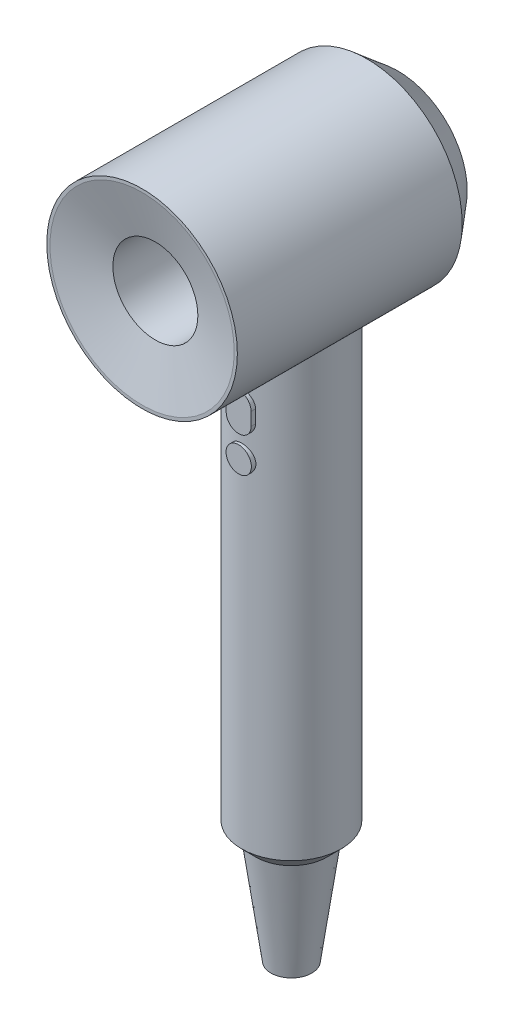
ISO-10303-21;
HEADER;
FILE_DESCRIPTION(('STEP AP214'),'2;1');
FILE_NAME('part.step','',(''),(''),'','','');
FILE_SCHEMA(('AUTOMOTIVE_DESIGN { 1 0 10303 214 1 1 1 1 }'));
ENDSEC;
DATA;
#1=APPLICATION_CONTEXT('core data for automotive mechanical design processes');
#2=APPLICATION_PROTOCOL_DEFINITION('international standard','automotive_design',2000,#1);
#3=PRODUCT_CONTEXT('',#1,'mechanical');
#4=PRODUCT('Part','Part','',(#3));
#5=PRODUCT_RELATED_PRODUCT_CATEGORY('part','',(#4));
#6=PRODUCT_DEFINITION_FORMATION('','',#4);
#7=PRODUCT_DEFINITION_CONTEXT('part definition',#1,'design');
#8=PRODUCT_DEFINITION('design','',#6,#7);
#9=PRODUCT_DEFINITION_SHAPE('','',#8);
#10=(LENGTH_UNIT() NAMED_UNIT(*) SI_UNIT(.MILLI.,.METRE.));
#11=(NAMED_UNIT(*) PLANE_ANGLE_UNIT() SI_UNIT($,.RADIAN.));
#12=(NAMED_UNIT(*) SI_UNIT($,.STERADIAN.) SOLID_ANGLE_UNIT());
#13=UNCERTAINTY_MEASURE_WITH_UNIT(LENGTH_MEASURE(1.E-05),#10,'distance_accuracy_value','');
#14=(GEOMETRIC_REPRESENTATION_CONTEXT(3) GLOBAL_UNCERTAINTY_ASSIGNED_CONTEXT((#13)) GLOBAL_UNIT_ASSIGNED_CONTEXT((#10,
#11,#12)) REPRESENTATION_CONTEXT('',''));
#15=CARTESIAN_POINT('',(0.,0.,0.));
#16=DIRECTION('',(0.,0.,1.));
#17=DIRECTION('',(1.,0.,0.));
#18=AXIS2_PLACEMENT_3D('',#15,#16,#17);
#19=CARTESIAN_POINT('',(-0.0245698483604395,194.743793997136,61.));
#20=DIRECTION('',(0.,0.,-1.));
#21=DIRECTION('',(-1.,0.,0.));
#22=AXIS2_PLACEMENT_3D('',#19,#20,#21);
#23=CYLINDRICAL_SURFACE('',#22,4.76266138417586);
#24=CARTESIAN_POINT('',(-0.0245698483604395,194.743793997136,40.));
#25=DIRECTION('',(0.,0.,1.));
#26=DIRECTION('',(-1.,0.,0.));
#27=AXIS2_PLACEMENT_3D('',#24,#25,#26);
#28=CIRCLE('',#27,4.76266138417586);
#29=CARTESIAN_POINT('',(4.73809153581542,194.743793997136,40.));
#30=VERTEX_POINT('',#29);
#31=CARTESIAN_POINT('',(-4.7872312325363,194.743793997136,40.));
#32=VERTEX_POINT('',#31);
#33=EDGE_CURVE('E121',#30,#32,#28,.T.);
#34=ORIENTED_EDGE('',*,*,#33,.T.);
#35=DIRECTION('',(0.,0.,-1.));
#36=VECTOR('',#35,1.);
#37=CARTESIAN_POINT('',(-4.7872312325363,194.743793997136,61.));
#38=LINE('',#37,#36);
#39=CARTESIAN_POINT('',(-4.7872312325363,194.743793997136,61.));
#40=VERTEX_POINT('',#39);
#41=EDGE_CURVE('E13',#40,#32,#38,.T.);
#42=ORIENTED_EDGE('',*,*,#41,.F.);
#43=CARTESIAN_POINT('',(-0.0245698483604395,194.743793997136,61.));
#44=DIRECTION('',(0.,0.,1.));
#45=DIRECTION('',(-1.,0.,0.));
#46=AXIS2_PLACEMENT_3D('',#43,#44,#45);
#47=CIRCLE('',#46,4.76266138417586);
#48=CARTESIAN_POINT('',(4.73809153581542,194.743793997136,61.));
#49=VERTEX_POINT('',#48);
#50=EDGE_CURVE('E109',#49,#40,#47,.T.);
#51=ORIENTED_EDGE('',*,*,#50,.F.);
#52=DIRECTION('',(0.,0.,-1.));
#53=VECTOR('',#52,1.);
#54=CARTESIAN_POINT('',(4.73809153581542,194.743793997136,61.));
#55=LINE('',#54,#53);
#56=EDGE_CURVE('E117',#49,#30,#55,.T.);
#57=ORIENTED_EDGE('',*,*,#56,.T.);
#58=EDGE_LOOP('',(#34,#42,#51,#57));
#59=FACE_BOUND('',#58,.T.);
#60=ADVANCED_FACE('F58',(#59),#23,.T.);
#61=CARTESIAN_POINT('',(-4.7872312325363,189.778466171081,61.));
#62=DIRECTION('',(1.,0.,0.));
#63=DIRECTION('',(0.,0.,-1.));
#64=AXIS2_PLACEMENT_3D('',#61,#62,#63);
#65=PLANE('',#64);
#66=DIRECTION('',(0.,-1.,0.));
#67=VECTOR('',#66,1.);
#68=CARTESIAN_POINT('',(-4.7872312325363,189.778466171081,40.));
#69=LINE('',#68,#67);
#70=CARTESIAN_POINT('',(-4.7872312325363,189.778466171081,40.));
#71=VERTEX_POINT('',#70);
#72=EDGE_CURVE('E113',#32,#71,#69,.T.);
#73=ORIENTED_EDGE('',*,*,#72,.T.);
#74=DIRECTION('',(0.,0.,-1.));
#75=VECTOR('',#74,1.);
#76=CARTESIAN_POINT('',(-4.7872312325363,189.778466171081,61.));
#77=LINE('',#76,#75);
#78=CARTESIAN_POINT('',(-4.7872312325363,189.778466171081,61.));
#79=VERTEX_POINT('',#78);
#80=EDGE_CURVE('E66',#79,#71,#77,.T.);
#81=ORIENTED_EDGE('',*,*,#80,.F.);
#82=DIRECTION('',(0.,-1.,0.));
#83=VECTOR('',#82,1.);
#84=CARTESIAN_POINT('',(-4.7872312325363,189.778466171081,61.));
#85=LINE('',#84,#83);
#86=EDGE_CURVE('E104',#40,#79,#85,.T.);
#87=ORIENTED_EDGE('',*,*,#86,.F.);
#88=ORIENTED_EDGE('',*,*,#41,.T.);
#89=EDGE_LOOP('',(#73,#81,#87,#88));
#90=FACE_BOUND('',#89,.T.);
#91=ADVANCED_FACE('F112',(#90),#65,.F.);
#92=CARTESIAN_POINT('',(-0.0245698483604395,189.778466171081,61.));
#93=DIRECTION('',(0.,0.,-1.));
#94=DIRECTION('',(-1.,0.,0.));
#95=AXIS2_PLACEMENT_3D('',#92,#93,#94);
#96=CYLINDRICAL_SURFACE('',#95,4.76266138417586);
#97=CARTESIAN_POINT('',(-0.0245698483604395,189.778466171081,40.));
#98=DIRECTION('',(0.,0.,1.));
#99=DIRECTION('',(-1.,0.,0.));
#100=AXIS2_PLACEMENT_3D('',#97,#98,#99);
#101=CIRCLE('',#100,4.76266138417586);
#102=CARTESIAN_POINT('',(4.73809153581542,189.778466171081,40.));
#103=VERTEX_POINT('',#102);
#104=EDGE_CURVE('E91',#71,#103,#101,.T.);
#105=ORIENTED_EDGE('',*,*,#104,.T.);
#106=DIRECTION('',(0.,0.,-1.));
#107=VECTOR('',#106,1.);
#108=CARTESIAN_POINT('',(4.73809153581542,189.778466171081,61.));
#109=LINE('',#108,#107);
#110=CARTESIAN_POINT('',(4.73809153581542,189.778466171081,61.));
#111=VERTEX_POINT('',#110);
#112=EDGE_CURVE('E114',#111,#103,#109,.T.);
#113=ORIENTED_EDGE('',*,*,#112,.F.);
#114=CARTESIAN_POINT('',(-0.0245698483604395,189.778466171081,61.));
#115=DIRECTION('',(0.,0.,1.));
#116=DIRECTION('',(-1.,0.,0.));
#117=AXIS2_PLACEMENT_3D('',#114,#115,#116);
#118=CIRCLE('',#117,4.76266138417586);
#119=EDGE_CURVE('E107',#79,#111,#118,.T.);
#120=ORIENTED_EDGE('',*,*,#119,.F.);
#121=ORIENTED_EDGE('',*,*,#80,.T.);
#122=EDGE_LOOP('',(#105,#113,#120,#121));
#123=FACE_BOUND('',#122,.T.);
#124=ADVANCED_FACE('F115',(#123),#96,.T.);
#125=CARTESIAN_POINT('',(4.73809153581542,194.743793997136,61.));
#126=DIRECTION('',(-1.,0.,0.));
#127=DIRECTION('',(0.,0.,1.));
#128=AXIS2_PLACEMENT_3D('',#125,#126,#127);
#129=PLANE('',#128);
#130=DIRECTION('',(0.,1.,0.));
#131=VECTOR('',#130,1.);
#132=CARTESIAN_POINT('',(4.73809153581542,194.743793997136,40.));
#133=LINE('',#132,#131);
#134=EDGE_CURVE('E97',#103,#30,#133,.T.);
#135=ORIENTED_EDGE('',*,*,#134,.T.);
#136=ORIENTED_EDGE('',*,*,#56,.F.);
#137=DIRECTION('',(0.,1.,0.));
#138=VECTOR('',#137,1.);
#139=CARTESIAN_POINT('',(4.73809153581542,194.743793997136,61.));
#140=LINE('',#139,#138);
#141=EDGE_CURVE('E74',#111,#49,#140,.T.);
#142=ORIENTED_EDGE('',*,*,#141,.F.);
#143=ORIENTED_EDGE('',*,*,#112,.T.);
#144=EDGE_LOOP('',(#135,#136,#142,#143));
#145=FACE_BOUND('',#144,.T.);
#146=ADVANCED_FACE('F128',(#145),#129,.F.);
#147=CARTESIAN_POINT('',(-0.0245698483604395,194.743793997136,61.));
#148=DIRECTION('',(0.,0.,-1.));
#149=DIRECTION('',(-1.,0.,0.));
#150=AXIS2_PLACEMENT_3D('',#147,#148,#149);
#151=PLANE('',#150);
#152=ORIENTED_EDGE('',*,*,#50,.T.);
#153=ORIENTED_EDGE('',*,*,#86,.T.);
#154=ORIENTED_EDGE('',*,*,#119,.T.);
#155=ORIENTED_EDGE('',*,*,#141,.T.);
#156=EDGE_LOOP('',(#152,#153,#154,#155));
#157=FACE_BOUND('',#156,.T.);
#158=ADVANCED_FACE('F105',(#157),#151,.F.);
#159=CARTESIAN_POINT('',(-0.0245698483604395,194.743793997136,40.));
#160=DIRECTION('',(0.,0.,-1.));
#161=DIRECTION('',(-1.,0.,0.));
#162=AXIS2_PLACEMENT_3D('',#159,#160,#161);
#163=PLANE('',#162);
#164=ORIENTED_EDGE('',*,*,#33,.F.);
#165=ORIENTED_EDGE('',*,*,#134,.F.);
#166=ORIENTED_EDGE('',*,*,#104,.F.);
#167=ORIENTED_EDGE('',*,*,#72,.F.);
#168=EDGE_LOOP('',(#164,#165,#166,#167));
#169=FACE_BOUND('',#168,.T.);
#170=ADVANCED_FACE('F131',(#169),#163,.T.);
#171=CLOSED_SHELL('',(#60,#91,#124,#146,#158,#170));
#172=MANIFOLD_SOLID_BREP('B2',#171);
#173=CARTESIAN_POINT('',(0.,176.503814227952,61.));
#174=DIRECTION('',(0.,0.,-1.));
#175=DIRECTION('',(-1.,0.,0.));
#176=AXIS2_PLACEMENT_3D('',#173,#174,#175);
#177=CYLINDRICAL_SURFACE('',#176,4.84601829714736);
#178=CARTESIAN_POINT('',(0.,176.503814227952,61.));
#179=DIRECTION('',(0.,0.,1.));
#180=DIRECTION('',(1.,0.,0.));
#181=AXIS2_PLACEMENT_3D('',#178,#179,#180);
#182=CIRCLE('',#181,4.84601829714736);
#183=CARTESIAN_POINT('',(4.84601829714736,176.503814227952,61.));
#184=VERTEX_POINT('',#183);
#185=EDGE_CURVE('E57',#184,#184,#182,.T.);
#186=ORIENTED_EDGE('',*,*,#185,.F.);
#187=EDGE_LOOP('',(#186));
#188=FACE_BOUND('',#187,.T.);
#189=CARTESIAN_POINT('',(0.,176.503814227952,40.));
#190=DIRECTION('',(0.,0.,1.));
#191=DIRECTION('',(1.,0.,0.));
#192=AXIS2_PLACEMENT_3D('',#189,#190,#191);
#193=CIRCLE('',#192,4.84601829714736);
#194=CARTESIAN_POINT('',(4.84601829714736,176.503814227952,40.));
#195=VERTEX_POINT('',#194);
#196=EDGE_CURVE('E192',#195,#195,#193,.T.);
#197=ORIENTED_EDGE('',*,*,#196,.T.);
#198=EDGE_LOOP('',(#197));
#199=FACE_BOUND('',#198,.T.);
#200=ADVANCED_FACE('F189',(#188,#199),#177,.T.);
#201=CARTESIAN_POINT('',(0.,176.503814227952,61.));
#202=DIRECTION('',(0.,0.,1.));
#203=DIRECTION('',(1.,0.,0.));
#204=AXIS2_PLACEMENT_3D('',#201,#202,#203);
#205=PLANE('',#204);
#206=ORIENTED_EDGE('',*,*,#185,.T.);
#207=EDGE_LOOP('',(#206));
#208=FACE_BOUND('',#207,.T.);
#209=ADVANCED_FACE('F204',(#208),#205,.T.);
#210=CARTESIAN_POINT('',(0.,176.503814227952,40.));
#211=DIRECTION('',(0.,0.,1.));
#212=DIRECTION('',(1.,0.,0.));
#213=AXIS2_PLACEMENT_3D('',#210,#211,#212);
#214=PLANE('',#213);
#215=ORIENTED_EDGE('',*,*,#196,.F.);
#216=EDGE_LOOP('',(#215));
#217=FACE_BOUND('',#216,.T.);
#218=ADVANCED_FACE('F202',(#217),#214,.F.);
#219=CLOSED_SHELL('',(#200,#209,#218));
#220=MANIFOLD_SOLID_BREP('B7',#219);
#221=CARTESIAN_POINT('',(1.11022302462516E-13,248.274519969354,98.));
#222=DIRECTION('',(0.,0.,-1.));
#223=DIRECTION('',(-1.,0.,0.));
#224=AXIS2_PLACEMENT_3D('',#221,#222,#223);
#225=CYLINDRICAL_SURFACE('',#224,36.4826501961415);
#226=CARTESIAN_POINT('',(1.11022302462516E-13,248.274519969354,11.917535925942));
#227=DIRECTION('',(0.,0.,1.));
#228=DIRECTION('',(1.,0.,0.));
#229=AXIS2_PLACEMENT_3D('',#226,#227,#228);
#230=CIRCLE('',#229,36.4826501961415);
#231=CARTESIAN_POINT('',(36.4826501961416,248.274519969354,11.917535925942));
#232=VERTEX_POINT('',#231);
#233=EDGE_CURVE('E237',#232,#232,#230,.T.);
#234=ORIENTED_EDGE('',*,*,#233,.T.);
#235=EDGE_LOOP('',(#234));
#236=FACE_BOUND('',#235,.T.);
#237=CARTESIAN_POINT('',(0.,211.791869773212,59.9095493020376));
#238=CARTESIAN_POINT('',(0.498903942082183,211.791869193612,59.9095500564646));
#239=CARTESIAN_POINT('',(0.997800418017843,211.802125818302,59.8899588136509));
#240=CARTESIAN_POINT('',(1.99188304117443,211.842889168534,59.8118336670004));
#241=CARTESIAN_POINT('',(2.48706773471261,211.873403447519,59.7532852372334));
#242=CARTESIAN_POINT('',(3.47050051507506,211.953958550671,59.5978503014503));
#243=CARTESIAN_POINT('',(3.95873738240978,212.004027903182,59.5009077804611));
#244=CARTESIAN_POINT('',(4.92400380826177,212.12241908089,59.269847248366));
#245=CARTESIAN_POINT('',(5.40103429688597,212.19073938543,59.1357323344033));
#246=CARTESIAN_POINT('',(6.33891025175676,212.343657828775,58.832402653579));
#247=CARTESIAN_POINT('',(6.79981325995625,212.428189171414,58.6633317041285));
#248=CARTESIAN_POINT('',(7.704770955944,212.611745766169,58.2914073762051));
#249=CARTESIAN_POINT('',(8.14882535175242,212.710771269318,58.0885534126137));
#250=CARTESIAN_POINT('',(9.01771559972236,212.92109914636,57.6508388508836));
#251=CARTESIAN_POINT('',(9.44255450571534,213.03239955972,57.415983362578));
#252=CARTESIAN_POINT('',(10.2711750841071,213.264922058321,56.9159692026788));
#253=CARTESIAN_POINT('',(10.6749549300252,213.386145001822,56.6508079089656));
#254=CARTESIAN_POINT('',(11.4850260610042,213.64404134703,56.0738870436414));
#255=CARTESIAN_POINT('',(11.8898075156644,213.781207012662,55.7602270314189));
#256=CARTESIAN_POINT('',(12.6718434746124,214.060770974813,55.1024178020636));
#257=CARTESIAN_POINT('',(13.0490969969633,214.203169457718,54.7582674982936));
#258=CARTESIAN_POINT('',(13.7747499933389,214.490021108415,54.0409922882267));
#259=CARTESIAN_POINT('',(14.1231268649438,214.634475783928,53.6678451198464));
#260=CARTESIAN_POINT('',(14.7891423782619,214.921909717534,52.8945037148832));
#261=CARTESIAN_POINT('',(15.1067795095139,215.064888902818,52.4943081508603));
#262=CARTESIAN_POINT('',(15.7359544992434,215.358046829545,51.6325801445666));
#263=CARTESIAN_POINT('',(16.0445552106486,215.507769055975,51.168740787601));
#264=CARTESIAN_POINT('',(16.6212705287736,215.796509482958,50.2133930769064));
#265=CARTESIAN_POINT('',(16.8893878912654,215.935528411787,49.7218866096555));
#266=CARTESIAN_POINT('',(17.3826359481922,216.197958721282,48.7140320182238));
#267=CARTESIAN_POINT('',(17.6077882582708,216.321377939528,48.1976965500435));
#268=CARTESIAN_POINT('',(18.0127051648197,216.547873136246,47.1432043297721));
#269=CARTESIAN_POINT('',(18.1924752493353,216.650951574186,46.6050502253392));
#270=CARTESIAN_POINT('',(18.4945117369379,216.826698918164,45.5447470403825));
#271=CARTESIAN_POINT('',(18.6196437551711,216.900852687152,45.0236620041971));
#272=CARTESIAN_POINT('',(18.8259357341679,217.024201127376,43.9699192683275));
#273=CARTESIAN_POINT('',(18.9070977492877,217.073396964684,43.4372621105229));
#274=CARTESIAN_POINT('',(19.0240460124975,217.144564095212,42.3657077318946));
#275=CARTESIAN_POINT('',(19.059877645118,217.166562617732,41.8268172983229));
#276=CARTESIAN_POINT('',(19.0856675653614,217.182377303399,40.7475528534586));
#277=CARTESIAN_POINT('',(19.0756310107172,217.176196635207,40.2071790157992));
#278=CARTESIAN_POINT('',(19.0143069061885,217.138674544179,39.2025594122427));
#279=CARTESIAN_POINT('',(18.9687300305484,217.110817366347,38.7378198550446));
#280=CARTESIAN_POINT('',(18.8439524039514,217.035208955622,37.8145675099738));
#281=CARTESIAN_POINT('',(18.7647552096035,216.987459827058,37.3560540687491));
#282=CARTESIAN_POINT('',(18.5736656701137,216.87364357262,36.4480966836742));
#283=CARTESIAN_POINT('',(18.4617634770695,216.807570929602,35.9986555152454));
#284=CARTESIAN_POINT('',(18.2064757551503,216.659179157247,35.1115604565937));
#285=CARTESIAN_POINT('',(18.0630884178625,216.576859094733,34.6739072450574));
#286=CARTESIAN_POINT('',(17.7425953580108,216.396335695892,33.8028905386461));
#287=CARTESIAN_POINT('',(17.564802531004,216.297816200118,33.3698460317048));
#288=CARTESIAN_POINT('',(17.179079959089,216.088947509886,32.5201643230799));
#289=CARTESIAN_POINT('',(16.9711377972416,215.978593446287,32.1035339718788));
#290=CARTESIAN_POINT('',(16.52655727509,215.748849117278,31.2884316249294));
#291=CARTESIAN_POINT('',(16.289915533808,215.629457787849,30.8899617762163));
#292=CARTESIAN_POINT('',(15.7892752587461,215.384396338695,30.1126070088077));
#293=CARTESIAN_POINT('',(15.5252743437139,215.258725672931,29.7337237991776));
#294=CARTESIAN_POINT('',(14.9322071641093,214.985874686671,28.9450317285036));
#295=CARTESIAN_POINT('',(14.5992108044442,214.838153245621,28.5383582423615));
#296=CARTESIAN_POINT('',(13.9009811791859,214.541889988999,27.7539862031804));
#297=CARTESIAN_POINT('',(13.535745339787,214.393348108819,27.3762899680178));
#298=CARTESIAN_POINT('',(12.774531282853,214.099065367796,26.6515514107999));
#299=CARTESIAN_POINT('',(12.3785355342971,213.953326164193,26.3045268138967));
#300=CARTESIAN_POINT('',(11.557798353244,213.668310070582,25.643393111455));
#301=CARTESIAN_POINT('',(11.1330581153505,213.52903291242,25.3292826394063));
#302=CARTESIAN_POINT('',(10.2324939597813,213.252902436619,24.7196477857472));
#303=CARTESIAN_POINT('',(9.755143605248,213.116610849186,24.4261170856618));
#304=CARTESIAN_POINT('',(8.77331559793282,212.858841530941,23.8807329263617));
#305=CARTESIAN_POINT('',(8.26883647924717,212.737364601802,23.6288817223043));
#306=CARTESIAN_POINT('',(7.23643224577196,212.512855547966,23.1697494874146));
#307=CARTESIAN_POINT('',(6.70852356906615,212.409810738925,22.9624377861346));
#308=CARTESIAN_POINT('',(5.63295543935523,212.225232250228,22.5947966053925));
#309=CARTESIAN_POINT('',(5.08529850951474,212.143695833513,22.4344611476604));
#310=CARTESIAN_POINT('',(4.02367740384683,212.010841457169,22.1749543618603));
#311=CARTESIAN_POINT('',(3.51097436694164,211.957499488754,22.0716501118355));
#312=CARTESIAN_POINT('',(2.47705976105866,211.87236479024,21.9073620959927));
#313=CARTESIAN_POINT('',(1.95584868089588,211.840570826569,21.8463759075611));
#314=CARTESIAN_POINT('',(0.909528317321504,211.799452686707,21.7675853153378));
#315=CARTESIAN_POINT('',(0.384420923133845,211.790118254153,21.7497612011439));
#316=CARTESIAN_POINT('',(-0.66537340052037,211.794162197201,21.7574938121755));
#317=CARTESIAN_POINT('',(-1.19006035072981,211.807539373202,21.7830482461983));
#318=CARTESIAN_POINT('',(-2.18921814936357,211.854481386349,21.8730808898464));
#319=CARTESIAN_POINT('',(-2.66410265040614,211.886197571326,21.9339965036698));
#320=CARTESIAN_POINT('',(-3.60643331811186,211.967481855119,22.0909929750075));
#321=CARTESIAN_POINT('',(-4.07388001634235,212.017048672141,22.1870713076149));
#322=CARTESIAN_POINT('',(-4.99832573108141,212.132888065767,22.4133579706043));
#323=CARTESIAN_POINT('',(-5.45532420037248,212.199161515191,22.5435680841789));
#324=CARTESIAN_POINT('',(-6.3561294909815,212.346929712811,22.8368176722343));
#325=CARTESIAN_POINT('',(-6.79993574441351,212.42842511517,22.9998585576409));
#326=CARTESIAN_POINT('',(-7.68336722083116,212.60719557407,23.3619806332182));
#327=CARTESIAN_POINT('',(-8.12257864459276,212.704827952135,23.561893770467));
#328=CARTESIAN_POINT('',(-8.98234213145659,212.912154730477,23.9930611439112));
#329=CARTESIAN_POINT('',(-9.40289407352497,213.021849208979,24.2243155833611));
#330=CARTESIAN_POINT('',(-10.2235721379162,213.25104338609,24.7165522283839));
#331=CARTESIAN_POINT('',(-10.6236924023861,213.370545871378,24.9775428909304));
#332=CARTESIAN_POINT('',(-11.401783205124,213.616913538935,25.5275773630126));
#333=CARTESIAN_POINT('',(-11.7797518849999,213.743779337173,25.8166235208571));
#334=CARTESIAN_POINT('',(-12.5505251779763,214.015913086689,26.452942878888));
#335=CARTESIAN_POINT('',(-12.9407285103267,214.161715595272,26.8031434888106));
#336=CARTESIAN_POINT('',(-13.6905816435833,214.455679428641,27.5339392000314));
#337=CARTESIAN_POINT('',(-14.0502294841717,214.603840904047,27.9145362484086));
#338=CARTESIAN_POINT('',(-14.7375977891708,214.89897570882,28.7046644233162));
#339=CARTESIAN_POINT('',(-15.0652918864507,215.045947966711,29.1142189718652));
#340=CARTESIAN_POINT('',(-15.5312114662793,215.262482780258,29.7485153409061));
#341=CARTESIAN_POINT('',(-15.6822524139675,215.334009478862,29.9632825010813));
#342=CARTESIAN_POINT('',(-15.9756453706037,215.475296894831,30.3993455914707));
#343=CARTESIAN_POINT('',(-16.1179944997642,215.54505702246,30.620643649876));
#344=CARTESIAN_POINT('',(-16.5484476998395,215.759301444761,31.3213491350747));
#345=CARTESIAN_POINT('',(-16.8208789387418,215.899802183988,31.8117545556657));
#346=CARTESIAN_POINT('',(-17.3228448721418,216.165587224573,32.8179969272785));
#347=CARTESIAN_POINT('',(-17.5523844889193,216.290873271403,33.3338309514942));
#348=CARTESIAN_POINT('',(-17.8624953887037,216.463688651295,34.1238919066173));
#349=CARTESIAN_POINT('',(-17.9601398853026,216.518759464119,34.3898752468776));
#350=CARTESIAN_POINT('',(-18.1437570477627,216.623311712507,34.9268351771187));
#351=CARTESIAN_POINT('',(-18.2297327037829,216.672794579445,35.1978104676136));
#352=CARTESIAN_POINT('',(-18.4697009336932,216.81202875833,36.0175471578565));
#353=CARTESIAN_POINT('',(-18.6058037470356,216.892604603268,36.5732946699038));
#354=CARTESIAN_POINT('',(-18.8170137415373,217.01884309429,37.6429111662931));
#355=CARTESIAN_POINT('',(-18.8967851317518,217.06714991156,38.1555589942756));
#356=CARTESIAN_POINT('',(-19.0143496384965,217.138639215082,39.187413615692));
#357=CARTESIAN_POINT('',(-19.0521457340967,217.161823484327,39.7066199410107));
#358=CARTESIAN_POINT('',(-19.0851214695621,217.182040531689,40.746624234408));
#359=CARTESIAN_POINT('',(-19.0803225431504,217.179086462562,41.2674212701686));
#360=CARTESIAN_POINT('',(-19.0282405672082,217.14718851684,42.3060636062432));
#361=CARTESIAN_POINT('',(-18.9809599423996,217.118246123576,42.823909073326));
#362=CARTESIAN_POINT('',(-18.8524194946347,217.04032521563,43.7938137668714));
#363=CARTESIAN_POINT('',(-18.7756101247334,216.993984559403,44.2466863377623));
#364=CARTESIAN_POINT('',(-18.5901231826813,216.883394832128,45.1435738133244));
#365=CARTESIAN_POINT('',(-18.4814486159577,216.819147450016,45.5875895491287));
#366=CARTESIAN_POINT('',(-18.2333457562769,216.674687029067,46.4643775471388));
#367=CARTESIAN_POINT('',(-18.093909433975,216.594469822368,46.8971468408036));
#368=CARTESIAN_POINT('',(-17.7855719507099,216.420344088925,47.7492199231832));
#369=CARTESIAN_POINT('',(-17.6166687305324,216.32643460541,48.1685227684054));
#370=CARTESIAN_POINT('',(-17.2387231355716,216.120835445997,49.0188385953159));
#371=CARTESIAN_POINT('',(-17.0277766451753,216.008384172761,49.4488205450675));
#372=CARTESIAN_POINT('',(-16.5753789175956,215.773665735848,50.2898389639274));
#373=CARTESIAN_POINT('',(-16.3339145758564,215.651394363631,50.7008671900832));
#374=CARTESIAN_POINT('',(-15.8219431513721,215.400043518436,51.5023535121827));
#375=CARTESIAN_POINT('',(-15.5514295535735,215.270962521539,51.8928069643034));
#376=CARTESIAN_POINT('',(-14.9827517650178,215.008938049415,52.6516709174042));
#377=CARTESIAN_POINT('',(-14.6845856236062,214.875994302159,53.0200798603092));
#378=CARTESIAN_POINT('',(-14.0190887177274,214.590735798951,53.7825308117801));
#379=CARTESIAN_POINT('',(-13.6478831467707,214.438268480307,54.1731432208179));
#380=CARTESIAN_POINT('',(-12.873178280648,214.136008773259,54.9221089959284));
#381=CARTESIAN_POINT('',(-12.4696760404007,213.986216630326,55.2804594137365));
#382=CARTESIAN_POINT('',(-11.6320306388974,213.693070901962,55.9629637370589));
#383=CARTESIAN_POINT('',(-11.1978677914904,213.549721551672,56.287095332454));
#384=CARTESIAN_POINT('',(-10.3012874896503,213.273273156174,56.8985742653752));
#385=CARTESIAN_POINT('',(-9.8388713385379,213.14017363878,57.185923297786));
#386=CARTESIAN_POINT('',(-8.87947243851488,212.885403908438,57.7263610085197));
#387=CARTESIAN_POINT('',(-8.38200946821761,212.763989757152,57.9787200886019));
#388=CARTESIAN_POINT('',(-7.36341772659126,212.538881275588,58.4401671510571));
#389=CARTESIAN_POINT('',(-6.8422856794961,212.435189407567,58.6492491215512));
#390=CARTESIAN_POINT('',(-5.78151025516843,212.248874086523,59.0210987616399));
#391=CARTESIAN_POINT('',(-5.24191440260664,212.16620057284,59.1839765877034));
#392=CARTESIAN_POINT('',(-4.14777685706545,212.024227164937,59.461753945803));
#393=CARTESIAN_POINT('',(-3.59324391830094,211.964913885208,59.5766809560967));
#394=CARTESIAN_POINT('',(-2.53349528646003,211.87648103448,59.7473713403268));
#395=CARTESIAN_POINT('',(-2.02928796208313,211.844826016336,59.8081174220323));
#396=CARTESIAN_POINT('',(-1.01671789930323,211.802520460292,59.8892064430549));
#397=CARTESIAN_POINT('',(-0.508355073801562,211.791870363792,59.9095485333189));
#398=CARTESIAN_POINT('',(0.,211.791869773212,59.9095493020376));
#399=B_SPLINE_CURVE_WITH_KNOTS('',3,(#237,#238,#239,#240,#241,#242,#243,#244,#245,#246,#247,
#248,#249,#250,#251,#252,#253,#254,#255,#256,#257,#258,#259,#260,#261,#262,#263,#264,#265,#266,
#267,#268,#269,#270,#271,#272,#273,#274,#275,#276,#277,#278,#279,#280,#281,#282,#283,#284,#285,
#286,#287,#288,#289,#290,#291,#292,#293,#294,#295,#296,#297,#298,#299,#300,#301,#302,#303,#304,
#305,#306,#307,#308,#309,#310,#311,#312,#313,#314,#315,#316,#317,#318,#319,#320,#321,#322,#323,
#324,#325,#326,#327,#328,#329,#330,#331,#332,#333,#334,#335,#336,#337,#338,#339,#340,#341,#342,
#343,#344,#345,#346,#347,#348,#349,#350,#351,#352,#353,#354,#355,#356,#357,#358,#359,#360,#361,
#362,#363,#364,#365,#366,#367,#368,#369,#370,#371,#372,#373,#374,#375,#376,#377,#378,#379,#380,
#381,#382,#383,#384,#385,#386,#387,#388,#389,#390,#391,#392,#393,#394,#395,#396,#397,#398),
.UNSPECIFIED.,.T.,.F.,(4,2,2,2,2,2,2,2,2,2,2,2,2,2,2,2,2,2,2,2,2,2,2,2,2,2,2,2,2,2,2,2,2,2,2,2,
2,2,2,2,2,2,2,2,2,2,2,2,2,2,2,2,2,2,2,2,2,2,2,2,2,2,2,2,2,2,2,2,2,2,2,2,2,2,2,2,2,2,2,2,4),(0.,
1.49621269361442,2.99298359153746,4.49194629210418,5.99078413905853,7.48357392884191,
8.97638957628181,10.4689671375758,11.9616739375951,13.5504189262134,15.1392205585811,
16.7292542647808,18.319366060972,20.0478775530391,21.776271329222,23.5037932476497,
25.23110615771,26.8517458800041,28.4723098766199,30.0912500860748,31.710008255292,
33.111748777847,34.5133410507306,35.9153557969353,37.3174510917595,38.7511465384377,
40.1854341356714,41.6198908647835,43.0544725493086,44.6906353612866,46.3269289129813,
47.9641619795229,49.601327045388,51.3291897317513,53.0571458772381,54.7839082897943,
56.5104508563294,58.0854703538437,59.6603996776055,61.234609658064,62.8087364932376,
64.2465385040739,65.6842372918311,67.1220112061961,68.5598469231159,70.0353334855324,
71.5108296172246,72.9867464320251,74.4627868911289,76.0936273298327,77.7245723178265,
79.3568519147918,80.173047007711,80.9895110725389,82.7220893528262,84.45446867864,
85.3200987695709,86.1855066209042,87.915747667156,89.4767390294437,91.0376195979982,
92.5977147793647,94.1577209210499,95.5411992182131,96.9245470719126,98.3082564311852,
99.6920625259943,101.166480117258,102.641532997519,104.116917390534,105.592405938787,
107.270557878472,108.948863020862,110.628255719823,112.307571007044,114.017857696829,
115.728381813424,117.434792877947,119.140224734552,120.664749331701,122.18930596501),.UNSPECIFIED.);
#400=CARTESIAN_POINT('',(0.,211.791869773212,59.9095493020376));
#401=VERTEX_POINT('',#400);
#402=EDGE_CURVE('E251',#401,#401,#399,.T.);
#403=ORIENTED_EDGE('',*,*,#402,.T.);
#404=EDGE_LOOP('',(#403));
#405=FACE_BOUND('',#404,.T.);
#406=CARTESIAN_POINT('',(1.11022302462516E-13,248.274519969354,98.));
#407=DIRECTION('',(0.,0.,1.));
#408=DIRECTION('',(1.,0.,0.));
#409=AXIS2_PLACEMENT_3D('',#406,#407,#408);
#410=CIRCLE('',#409,36.4826501961415);
#411=CARTESIAN_POINT('',(36.4826501961416,248.274519969354,98.));
#412=VERTEX_POINT('',#411);
#413=EDGE_CURVE('E250',#412,#412,#410,.T.);
#414=ORIENTED_EDGE('',*,*,#413,.F.);
#415=EDGE_LOOP('',(#414));
#416=FACE_BOUND('',#415,.T.);
#417=ADVANCED_FACE('F230',(#236,#405,#416),#225,.T.);
#418=CARTESIAN_POINT('',(1.11022302462516E-13,248.274519969354,98.));
#419=DIRECTION('',(0.,0.,-1.));
#420=DIRECTION('',(-1.,0.,0.));
#421=AXIS2_PLACEMENT_3D('',#418,#419,#420);
#422=CYLINDRICAL_SURFACE('',#421,16.269737133839);
#423=CARTESIAN_POINT('',(1.11022302462516E-13,248.274519969354,92.9089653438086));
#424=DIRECTION('',(0.,0.,1.));
#425=DIRECTION('',(1.,0.,0.));
#426=AXIS2_PLACEMENT_3D('',#423,#424,#425);
#427=CIRCLE('',#426,16.269737133839);
#428=CARTESIAN_POINT('',(16.2697371338391,248.274519969354,92.9089653438086));
#429=VERTEX_POINT('',#428);
#430=EDGE_CURVE('E245',#429,#429,#427,.T.);
#431=ORIENTED_EDGE('',*,*,#430,.T.);
#432=EDGE_LOOP('',(#431));
#433=FACE_BOUND('',#432,.T.);
#434=CARTESIAN_POINT('',(1.11022302462516E-13,248.274519969354,0.));
#435=DIRECTION('',(0.,0.,1.));
#436=DIRECTION('',(1.,0.,0.));
#437=AXIS2_PLACEMENT_3D('',#434,#435,#436);
#438=CIRCLE('',#437,16.269737133839);
#439=CARTESIAN_POINT('',(16.2697371338391,248.274519969354,0.));
#440=VERTEX_POINT('',#439);
#441=EDGE_CURVE('E259',#440,#440,#438,.T.);
#442=ORIENTED_EDGE('',*,*,#441,.F.);
#443=EDGE_LOOP('',(#442));
#444=FACE_BOUND('',#443,.T.);
#445=ADVANCED_FACE('F278',(#433,#444),#422,.F.);
#446=CARTESIAN_POINT('',(0.,0.,0.));
#447=DIRECTION('',(0.,0.,1.));
#448=DIRECTION('',(1.,0.,0.));
#449=AXIS2_PLACEMENT_3D('',#446,#447,#448);
#450=PLANE('',#449);
#451=CARTESIAN_POINT('',(1.11022302462516E-13,248.274519969354,0.));
#452=DIRECTION('',(0.,0.,1.));
#453=DIRECTION('',(1.,0.,0.));
#454=AXIS2_PLACEMENT_3D('',#451,#452,#453);
#455=CIRCLE('',#454,26.4826501961415);
#456=CARTESIAN_POINT('',(26.4826501961417,248.274519969354,0.));
#457=VERTEX_POINT('',#456);
#458=EDGE_CURVE('E188',#457,#457,#455,.F.);
#459=ORIENTED_EDGE('',*,*,#458,.T.);
#460=EDGE_LOOP('',(#459));
#461=FACE_BOUND('',#460,.T.);
#462=ORIENTED_EDGE('',*,*,#441,.T.);
#463=EDGE_LOOP('',(#462));
#464=FACE_BOUND('',#463,.T.);
#465=ADVANCED_FACE('F275',(#461,#464),#450,.F.);
#466=CARTESIAN_POINT('',(0.,0.,98.));
#467=DIRECTION('',(0.,0.,1.));
#468=DIRECTION('',(1.,0.,0.));
#469=AXIS2_PLACEMENT_3D('',#466,#467,#468);
#470=PLANE('',#469);
#471=CARTESIAN_POINT('',(1.11022302462516E-13,248.274519969354,98.));
#472=DIRECTION('',(0.,0.,1.));
#473=DIRECTION('',(1.,0.,0.));
#474=AXIS2_PLACEMENT_3D('',#471,#472,#473);
#475=CIRCLE('',#474,35.2697371338393);
#476=CARTESIAN_POINT('',(35.2697371338395,248.274519969354,98.));
#477=VERTEX_POINT('',#476);
#478=EDGE_CURVE('E241',#477,#477,#475,.F.);
#479=ORIENTED_EDGE('',*,*,#478,.T.);
#480=EDGE_LOOP('',(#479));
#481=FACE_BOUND('',#480,.T.);
#482=ORIENTED_EDGE('',*,*,#413,.T.);
#483=EDGE_LOOP('',(#482));
#484=FACE_BOUND('',#483,.T.);
#485=ADVANCED_FACE('F271',(#481,#484),#470,.T.);
#486=CARTESIAN_POINT('',(0.,217.756891216148,40.8313298131314));
#487=DIRECTION('',(0.,1.,0.));
#488=DIRECTION('',(0.,0.,1.));
#489=AXIS2_PLACEMENT_3D('',#486,#487,#488);
#490=CYLINDRICAL_SURFACE('',#489,19.0782194889062);
#491=CARTESIAN_POINT('',(0.,46.820189578784,40.8313298131314));
#492=DIRECTION('',(0.,1.,0.));
#493=DIRECTION('',(0.,0.,1.));
#494=AXIS2_PLACEMENT_3D('',#491,#492,#493);
#495=CIRCLE('',#494,19.0782194889062);
#496=CARTESIAN_POINT('',(0.,46.820189578784,59.9095493020376));
#497=VERTEX_POINT('',#496);
#498=EDGE_CURVE('E260',#497,#497,#495,.T.);
#499=ORIENTED_EDGE('',*,*,#498,.T.);
#500=EDGE_LOOP('',(#499));
#501=FACE_BOUND('',#500,.T.);
#502=ORIENTED_EDGE('',*,*,#402,.F.);
#503=EDGE_LOOP('',(#502));
#504=FACE_BOUND('',#503,.T.);
#505=ADVANCED_FACE('F265',(#501,#504),#490,.T.);
#506=CARTESIAN_POINT('',(0.,46.820189578784,40.8313298131314));
#507=DIRECTION('',(0.,1.,0.));
#508=DIRECTION('',(0.,0.,1.));
#509=AXIS2_PLACEMENT_3D('',#506,#507,#508);
#510=CONICAL_SURFACE('',#509,19.0782194889062,0.785398163397464);
#511=CARTESIAN_POINT('',(0.,41.2812314530618,40.8313298131314));
#512=DIRECTION('',(0.,1.,0.));
#513=DIRECTION('',(0.,0.,1.));
#514=AXIS2_PLACEMENT_3D('',#511,#512,#513);
#515=CIRCLE('',#514,13.5392613631838);
#516=CARTESIAN_POINT('',(0.,41.2812314530618,54.3705911763152));
#517=VERTEX_POINT('',#516);
#518=EDGE_CURVE('E297',#517,#517,#515,.T.);
#519=ORIENTED_EDGE('',*,*,#518,.T.);
#520=EDGE_LOOP('',(#519));
#521=FACE_BOUND('',#520,.T.);
#522=ORIENTED_EDGE('',*,*,#498,.F.);
#523=EDGE_LOOP('',(#522));
#524=FACE_BOUND('',#523,.T.);
#525=ADVANCED_FACE('F270',(#521,#524),#510,.T.);
#526=CARTESIAN_POINT('',(0.,41.2812314530618,40.8313298131314));
#527=DIRECTION('',(0.,1.,0.));
#528=DIRECTION('',(0.,0.,1.));
#529=AXIS2_PLACEMENT_3D('',#526,#527,#528);
#530=CONICAL_SURFACE('',#529,13.5392613631838,0.137426333126518);
#531=CARTESIAN_POINT('',(0.,0.,40.8313298131314));
#532=DIRECTION('',(0.,1.,0.));
#533=DIRECTION('',(0.,0.,1.));
#534=AXIS2_PLACEMENT_3D('',#531,#532,#533);
#535=CIRCLE('',#534,7.83014699190834);
#536=CARTESIAN_POINT('',(0.,0.,48.6614768050397));
#537=VERTEX_POINT('',#536);
#538=EDGE_CURVE('E300',#537,#537,#535,.T.);
#539=ORIENTED_EDGE('',*,*,#538,.T.);
#540=EDGE_LOOP('',(#539));
#541=FACE_BOUND('',#540,.T.);
#542=ORIENTED_EDGE('',*,*,#518,.F.);
#543=EDGE_LOOP('',(#542));
#544=FACE_BOUND('',#543,.T.);
#545=ADVANCED_FACE('F304',(#541,#544),#530,.T.);
#546=CARTESIAN_POINT('',(0.,0.,48.6614768050397));
#547=DIRECTION('',(0.,-1.,0.));
#548=DIRECTION('',(0.,0.,-1.));
#549=AXIS2_PLACEMENT_3D('',#546,#547,#548);
#550=PLANE('',#549);
#551=ORIENTED_EDGE('',*,*,#538,.F.);
#552=EDGE_LOOP('',(#551));
#553=FACE_BOUND('',#552,.T.);
#554=ADVANCED_FACE('F307',(#553),#550,.T.);
#555=CARTESIAN_POINT('',(1.11022302462516E-13,248.274519969354,92.9089653438086));
#556=DIRECTION('',(0.,0.,1.));
#557=DIRECTION('',(1.,0.,0.));
#558=AXIS2_PLACEMENT_3D('',#555,#556,#557);
#559=CONICAL_SURFACE('',#558,16.269737133839,1.30899693899575);
#560=ORIENTED_EDGE('',*,*,#478,.F.);
#561=EDGE_LOOP('',(#560));
#562=FACE_BOUND('',#561,.T.);
#563=ORIENTED_EDGE('',*,*,#430,.F.);
#564=EDGE_LOOP('',(#563));
#565=FACE_BOUND('',#564,.T.);
#566=ADVANCED_FACE('F309',(#562,#565),#559,.F.);
#567=CARTESIAN_POINT('',(1.11022302462516E-13,248.274519969354,11.917535925942));
#568=DIRECTION('',(0.,0.,1.));
#569=DIRECTION('',(1.,0.,0.));
#570=AXIS2_PLACEMENT_3D('',#567,#568,#569);
#571=CONICAL_SURFACE('',#570,36.4826501961415,0.698131700797734);
#572=ORIENTED_EDGE('',*,*,#458,.F.);
#573=EDGE_LOOP('',(#572));
#574=FACE_BOUND('',#573,.T.);
#575=ORIENTED_EDGE('',*,*,#233,.F.);
#576=EDGE_LOOP('',(#575));
#577=FACE_BOUND('',#576,.T.);
#578=ADVANCED_FACE('F232',(#574,#577),#571,.T.);
#579=CLOSED_SHELL('',(#417,#445,#465,#485,#505,#525,#545,#554,#566,#578));
#580=MANIFOLD_SOLID_BREP('B52',#579);
#581=ADVANCED_BREP_SHAPE_REPRESENTATION('',(#18,#172,#220,#580),#14);
#582=SHAPE_DEFINITION_REPRESENTATION(#9,#581);
ENDSEC;
END-ISO-10303-21;
